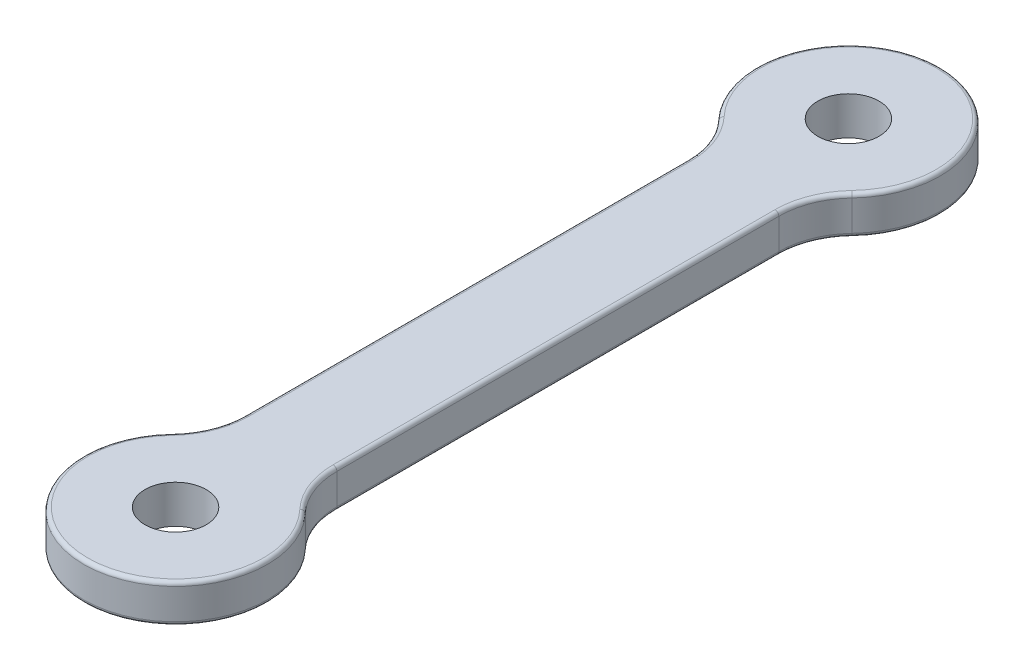
ISO-10303-21;
HEADER;
FILE_DESCRIPTION(('STEP AP214'),'2;1');
FILE_NAME('part.step','',(''),(''),'','','');
FILE_SCHEMA(('AUTOMOTIVE_DESIGN { 1 0 10303 214 1 1 1 1 }'));
ENDSEC;
DATA;
#1=APPLICATION_CONTEXT('core data for automotive mechanical design processes');
#2=APPLICATION_PROTOCOL_DEFINITION('international standard','automotive_design',2000,#1);
#3=PRODUCT_CONTEXT('',#1,'mechanical');
#4=PRODUCT('Part','Part','',(#3));
#5=PRODUCT_RELATED_PRODUCT_CATEGORY('part','',(#4));
#6=PRODUCT_DEFINITION_FORMATION('','',#4);
#7=PRODUCT_DEFINITION_CONTEXT('part definition',#1,'design');
#8=PRODUCT_DEFINITION('design','',#6,#7);
#9=PRODUCT_DEFINITION_SHAPE('','',#8);
#10=(LENGTH_UNIT() NAMED_UNIT(*) SI_UNIT(.MILLI.,.METRE.));
#11=(NAMED_UNIT(*) PLANE_ANGLE_UNIT() SI_UNIT($,.RADIAN.));
#12=(NAMED_UNIT(*) SI_UNIT($,.STERADIAN.) SOLID_ANGLE_UNIT());
#13=UNCERTAINTY_MEASURE_WITH_UNIT(LENGTH_MEASURE(1.E-05),#10,'distance_accuracy_value','');
#14=(GEOMETRIC_REPRESENTATION_CONTEXT(3) GLOBAL_UNCERTAINTY_ASSIGNED_CONTEXT((#13)) GLOBAL_UNIT_ASSIGNED_CONTEXT((#10,
#11,#12)) REPRESENTATION_CONTEXT('',''));
#15=CARTESIAN_POINT('',(0.,0.,0.));
#16=DIRECTION('',(0.,0.,1.));
#17=DIRECTION('',(1.,0.,0.));
#18=AXIS2_PLACEMENT_3D('',#15,#16,#17);
#19=CARTESIAN_POINT('',(0.,2.5,22.));
#20=DIRECTION('',(0.,-1.,0.));
#21=DIRECTION('',(0.,0.,-1.));
#22=AXIS2_PLACEMENT_3D('',#19,#20,#21);
#23=CYLINDRICAL_SURFACE('',#22,6.);
#24=DIRECTION('',(0.,-1.,0.));
#25=VECTOR('',#24,1.);
#26=CARTESIAN_POINT('',(4.36363636363637,2.5,17.8819084898523));
#27=LINE('',#26,#25);
#28=CARTESIAN_POINT('',(4.36363636363637,0.25,17.8819084898523));
#29=VERTEX_POINT('',#28);
#30=CARTESIAN_POINT('',(4.36363636363637,2.25,17.8819084898523));
#31=VERTEX_POINT('',#30);
#32=EDGE_CURVE('E306',#29,#31,#27,.F.);
#33=ORIENTED_EDGE('',*,*,#32,.T.);
#34=CARTESIAN_POINT('',(0.,2.25,22.));
#35=DIRECTION('',(0.,1.,0.));
#36=DIRECTION('',(0.,0.,1.));
#37=AXIS2_PLACEMENT_3D('',#34,#35,#36);
#38=CIRCLE('',#37,6.);
#39=CARTESIAN_POINT('',(-4.36363636363636,2.25,17.8819084898523));
#40=VERTEX_POINT('',#39);
#41=EDGE_CURVE('E11',#31,#40,#38,.F.);
#42=ORIENTED_EDGE('',*,*,#41,.T.);
#43=DIRECTION('',(0.,-1.,0.));
#44=VECTOR('',#43,1.);
#45=CARTESIAN_POINT('',(-4.36363636363636,2.5,17.8819084898523));
#46=LINE('',#45,#44);
#47=CARTESIAN_POINT('',(-4.36363636363636,0.25,17.8819084898523));
#48=VERTEX_POINT('',#47);
#49=EDGE_CURVE('E303',#40,#48,#46,.T.);
#50=ORIENTED_EDGE('',*,*,#49,.T.);
#51=CARTESIAN_POINT('',(0.,0.25,22.));
#52=DIRECTION('',(0.,1.,0.));
#53=DIRECTION('',(0.,0.,1.));
#54=AXIS2_PLACEMENT_3D('',#51,#52,#53);
#55=CIRCLE('',#54,6.);
#56=EDGE_CURVE('E48',#48,#29,#55,.T.);
#57=ORIENTED_EDGE('',*,*,#56,.T.);
#58=EDGE_LOOP('',(#33,#42,#50,#57));
#59=FACE_BOUND('',#58,.T.);
#60=ADVANCED_FACE('F39',(#59),#23,.T.);
#61=CARTESIAN_POINT('',(3.,2.5,0.));
#62=DIRECTION('',(-1.,0.,0.));
#63=DIRECTION('',(0.,0.,1.));
#64=AXIS2_PLACEMENT_3D('',#61,#62,#63);
#65=PLANE('',#64);
#66=DIRECTION('',(0.,1.,0.));
#67=VECTOR('',#66,1.);
#68=CARTESIAN_POINT('',(3.,2.5,-14.4501655647292));
#69=LINE('',#68,#67);
#70=CARTESIAN_POINT('',(3.,0.25,-14.4501655647292));
#71=VERTEX_POINT('',#70);
#72=CARTESIAN_POINT('',(3.,2.25,-14.4501655647292));
#73=VERTEX_POINT('',#72);
#74=EDGE_CURVE('E287',#71,#73,#69,.T.);
#75=ORIENTED_EDGE('',*,*,#74,.T.);
#76=DIRECTION('',(0.,0.,-1.));
#77=VECTOR('',#76,1.);
#78=CARTESIAN_POINT('',(3.,2.25,14.4501655647292));
#79=LINE('',#78,#77);
#80=CARTESIAN_POINT('',(3.,2.25,14.4501655647292));
#81=VERTEX_POINT('',#80);
#82=EDGE_CURVE('E209',#73,#81,#79,.F.);
#83=ORIENTED_EDGE('',*,*,#82,.T.);
#84=DIRECTION('',(0.,1.,0.));
#85=VECTOR('',#84,1.);
#86=CARTESIAN_POINT('',(3.,0.,14.4501655647292));
#87=LINE('',#86,#85);
#88=CARTESIAN_POINT('',(3.,0.25,14.4501655647292));
#89=VERTEX_POINT('',#88);
#90=EDGE_CURVE('E293',#81,#89,#87,.F.);
#91=ORIENTED_EDGE('',*,*,#90,.T.);
#92=DIRECTION('',(0.,0.,-1.));
#93=VECTOR('',#92,1.);
#94=CARTESIAN_POINT('',(3.,0.25,0.));
#95=LINE('',#94,#93);
#96=EDGE_CURVE('E207',#89,#71,#95,.T.);
#97=ORIENTED_EDGE('',*,*,#96,.T.);
#98=EDGE_LOOP('',(#75,#83,#91,#97));
#99=FACE_BOUND('',#98,.T.);
#100=ADVANCED_FACE('F379',(#99),#65,.F.);
#101=CARTESIAN_POINT('',(0.,2.5,-22.));
#102=DIRECTION('',(0.,-1.,0.));
#103=DIRECTION('',(0.,0.,-1.));
#104=AXIS2_PLACEMENT_3D('',#101,#102,#103);
#105=CYLINDRICAL_SURFACE('',#104,6.);
#106=DIRECTION('',(0.,-1.,0.));
#107=VECTOR('',#106,1.);
#108=CARTESIAN_POINT('',(-4.36363636363636,2.5,-17.8819084898523));
#109=LINE('',#108,#107);
#110=CARTESIAN_POINT('',(-4.36363636363636,0.25,-17.8819084898523));
#111=VERTEX_POINT('',#110);
#112=CARTESIAN_POINT('',(-4.36363636363636,2.25,-17.8819084898523));
#113=VERTEX_POINT('',#112);
#114=EDGE_CURVE('E294',#111,#113,#109,.F.);
#115=ORIENTED_EDGE('',*,*,#114,.T.);
#116=CARTESIAN_POINT('',(0.,2.25,-22.));
#117=DIRECTION('',(0.,1.,0.));
#118=DIRECTION('',(0.,0.,1.));
#119=AXIS2_PLACEMENT_3D('',#116,#117,#118);
#120=CIRCLE('',#119,6.);
#121=CARTESIAN_POINT('',(4.36363636363637,2.25,-17.8819084898523));
#122=VERTEX_POINT('',#121);
#123=EDGE_CURVE('E201',#113,#122,#120,.F.);
#124=ORIENTED_EDGE('',*,*,#123,.T.);
#125=DIRECTION('',(0.,-1.,0.));
#126=VECTOR('',#125,1.);
#127=CARTESIAN_POINT('',(4.36363636363637,2.5,-17.8819084898523));
#128=LINE('',#127,#126);
#129=CARTESIAN_POINT('',(4.36363636363637,0.25,-17.8819084898523));
#130=VERTEX_POINT('',#129);
#131=EDGE_CURVE('E284',#122,#130,#128,.T.);
#132=ORIENTED_EDGE('',*,*,#131,.T.);
#133=CARTESIAN_POINT('',(0.,0.25,-22.));
#134=DIRECTION('',(0.,1.,0.));
#135=DIRECTION('',(0.,0.,1.));
#136=AXIS2_PLACEMENT_3D('',#133,#134,#135);
#137=CIRCLE('',#136,6.);
#138=EDGE_CURVE('E199',#130,#111,#137,.T.);
#139=ORIENTED_EDGE('',*,*,#138,.T.);
#140=EDGE_LOOP('',(#115,#124,#132,#139));
#141=FACE_BOUND('',#140,.T.);
#142=ADVANCED_FACE('F290',(#141),#105,.T.);
#143=CARTESIAN_POINT('',(0.,2.5,22.));
#144=DIRECTION('',(0.,-1.,0.));
#145=DIRECTION('',(0.,0.,-1.));
#146=AXIS2_PLACEMENT_3D('',#143,#144,#145);
#147=CYLINDRICAL_SURFACE('',#146,2.);
#148=CARTESIAN_POINT('',(0.,2.5,22.));
#149=DIRECTION('',(0.,1.,0.));
#150=DIRECTION('',(0.,0.,1.));
#151=AXIS2_PLACEMENT_3D('',#148,#149,#150);
#152=CIRCLE('',#151,2.);
#153=CARTESIAN_POINT('',(0.,2.5,24.));
#154=VERTEX_POINT('',#153);
#155=EDGE_CURVE('E610',#154,#154,#152,.T.);
#156=ORIENTED_EDGE('',*,*,#155,.T.);
#157=EDGE_LOOP('',(#156));
#158=FACE_BOUND('',#157,.T.);
#159=CARTESIAN_POINT('',(0.,0.,22.));
#160=DIRECTION('',(0.,1.,0.));
#161=DIRECTION('',(0.,0.,1.));
#162=AXIS2_PLACEMENT_3D('',#159,#160,#161);
#163=CIRCLE('',#162,2.);
#164=CARTESIAN_POINT('',(0.,0.,24.));
#165=VERTEX_POINT('',#164);
#166=EDGE_CURVE('E248',#165,#165,#163,.T.);
#167=ORIENTED_EDGE('',*,*,#166,.F.);
#168=EDGE_LOOP('',(#167));
#169=FACE_BOUND('',#168,.T.);
#170=ADVANCED_FACE('F568',(#158,#169),#147,.F.);
#171=CARTESIAN_POINT('',(-3.,2.5,0.));
#172=DIRECTION('',(-1.,0.,0.));
#173=DIRECTION('',(0.,0.,1.));
#174=AXIS2_PLACEMENT_3D('',#171,#172,#173);
#175=PLANE('',#174);
#176=DIRECTION('',(0.,-1.,0.));
#177=VECTOR('',#176,1.);
#178=CARTESIAN_POINT('',(-3.,2.5,14.4501655647292));
#179=LINE('',#178,#177);
#180=CARTESIAN_POINT('',(-3.,0.25,14.4501655647292));
#181=VERTEX_POINT('',#180);
#182=CARTESIAN_POINT('',(-3.,2.25,14.4501655647292));
#183=VERTEX_POINT('',#182);
#184=EDGE_CURVE('E175',#181,#183,#179,.F.);
#185=ORIENTED_EDGE('',*,*,#184,.T.);
#186=DIRECTION('',(0.,0.,-1.));
#187=VECTOR('',#186,1.);
#188=CARTESIAN_POINT('',(-3.,2.25,0.));
#189=LINE('',#188,#187);
#190=CARTESIAN_POINT('',(-3.,2.25,-14.4501655647292));
#191=VERTEX_POINT('',#190);
#192=EDGE_CURVE('E193',#183,#191,#189,.T.);
#193=ORIENTED_EDGE('',*,*,#192,.T.);
#194=DIRECTION('',(0.,-1.,0.));
#195=VECTOR('',#194,1.);
#196=CARTESIAN_POINT('',(-3.,2.5,-14.4501655647292));
#197=LINE('',#196,#195);
#198=CARTESIAN_POINT('',(-3.,0.25,-14.4501655647292));
#199=VERTEX_POINT('',#198);
#200=EDGE_CURVE('E309',#191,#199,#197,.T.);
#201=ORIENTED_EDGE('',*,*,#200,.T.);
#202=DIRECTION('',(0.,0.,-1.));
#203=VECTOR('',#202,1.);
#204=CARTESIAN_POINT('',(-3.,0.25,14.4501655647292));
#205=LINE('',#204,#203);
#206=EDGE_CURVE('E191',#199,#181,#205,.F.);
#207=ORIENTED_EDGE('',*,*,#206,.T.);
#208=EDGE_LOOP('',(#185,#193,#201,#207));
#209=FACE_BOUND('',#208,.T.);
#210=ADVANCED_FACE('F336',(#209),#175,.T.);
#211=CARTESIAN_POINT('',(0.,2.5,-22.));
#212=DIRECTION('',(0.,-1.,0.));
#213=DIRECTION('',(0.,0.,-1.));
#214=AXIS2_PLACEMENT_3D('',#211,#212,#213);
#215=CYLINDRICAL_SURFACE('',#214,2.);
#216=CARTESIAN_POINT('',(0.,2.5,-22.));
#217=DIRECTION('',(0.,1.,0.));
#218=DIRECTION('',(0.,0.,1.));
#219=AXIS2_PLACEMENT_3D('',#216,#217,#218);
#220=CIRCLE('',#219,2.);
#221=CARTESIAN_POINT('',(0.,2.5,-20.));
#222=VERTEX_POINT('',#221);
#223=EDGE_CURVE('E298',#222,#222,#220,.T.);
#224=ORIENTED_EDGE('',*,*,#223,.T.);
#225=EDGE_LOOP('',(#224));
#226=FACE_BOUND('',#225,.T.);
#227=CARTESIAN_POINT('',(0.,0.,-22.));
#228=DIRECTION('',(0.,1.,0.));
#229=DIRECTION('',(0.,0.,1.));
#230=AXIS2_PLACEMENT_3D('',#227,#228,#229);
#231=CIRCLE('',#230,2.);
#232=CARTESIAN_POINT('',(0.,0.,-20.));
#233=VERTEX_POINT('',#232);
#234=EDGE_CURVE('E613',#233,#233,#231,.T.);
#235=ORIENTED_EDGE('',*,*,#234,.F.);
#236=EDGE_LOOP('',(#235));
#237=FACE_BOUND('',#236,.T.);
#238=ADVANCED_FACE('F556',(#226,#237),#215,.F.);
#239=CARTESIAN_POINT('',(0.,2.5,0.));
#240=DIRECTION('',(0.,1.,0.));
#241=DIRECTION('',(0.,0.,1.));
#242=AXIS2_PLACEMENT_3D('',#239,#240,#241);
#243=PLANE('',#242);
#244=DIRECTION('',(0.,0.,-1.));
#245=VECTOR('',#244,1.);
#246=CARTESIAN_POINT('',(-2.75,2.5,0.));
#247=LINE('',#246,#245);
#248=CARTESIAN_POINT('',(-2.75,2.5,-14.4501655647292));
#249=VERTEX_POINT('',#248);
#250=CARTESIAN_POINT('',(-2.75,2.5,14.4501655647292));
#251=VERTEX_POINT('',#250);
#252=EDGE_CURVE('E180',#249,#251,#247,.F.);
#253=ORIENTED_EDGE('',*,*,#252,.T.);
#254=CARTESIAN_POINT('',(-8.,2.5,14.4501655647292));
#255=DIRECTION('',(0.,1.,0.));
#256=DIRECTION('',(0.,0.,1.));
#257=AXIS2_PLACEMENT_3D('',#254,#255,#256);
#258=CIRCLE('',#257,5.25);
#259=CARTESIAN_POINT('',(-4.18181818181818,2.5,18.0534956361085));
#260=VERTEX_POINT('',#259);
#261=EDGE_CURVE('E160',#251,#260,#258,.F.);
#262=ORIENTED_EDGE('',*,*,#261,.T.);
#263=CARTESIAN_POINT('',(0.,2.5,22.));
#264=DIRECTION('',(0.,1.,0.));
#265=DIRECTION('',(0.,0.,1.));
#266=AXIS2_PLACEMENT_3D('',#263,#264,#265);
#267=CIRCLE('',#266,5.75);
#268=CARTESIAN_POINT('',(4.18181818181818,2.5,18.0534956361085));
#269=VERTEX_POINT('',#268);
#270=EDGE_CURVE('E168',#260,#269,#267,.T.);
#271=ORIENTED_EDGE('',*,*,#270,.T.);
#272=CARTESIAN_POINT('',(8.,2.5,14.4501655647292));
#273=DIRECTION('',(0.,1.,0.));
#274=DIRECTION('',(0.,0.,1.));
#275=AXIS2_PLACEMENT_3D('',#272,#273,#274);
#276=CIRCLE('',#275,5.25);
#277=CARTESIAN_POINT('',(2.75,2.5,14.4501655647292));
#278=VERTEX_POINT('',#277);
#279=EDGE_CURVE('E174',#269,#278,#276,.F.);
#280=ORIENTED_EDGE('',*,*,#279,.T.);
#281=DIRECTION('',(0.,0.,-1.));
#282=VECTOR('',#281,1.);
#283=CARTESIAN_POINT('',(2.75,2.5,-14.4501655647292));
#284=LINE('',#283,#282);
#285=CARTESIAN_POINT('',(2.75,2.5,-14.4501655647292));
#286=VERTEX_POINT('',#285);
#287=EDGE_CURVE('E315',#278,#286,#284,.T.);
#288=ORIENTED_EDGE('',*,*,#287,.T.);
#289=CARTESIAN_POINT('',(8.,2.5,-14.4501655647292));
#290=DIRECTION('',(0.,1.,0.));
#291=DIRECTION('',(0.,0.,1.));
#292=AXIS2_PLACEMENT_3D('',#289,#290,#291);
#293=CIRCLE('',#292,5.25);
#294=CARTESIAN_POINT('',(4.18181818181818,2.5,-18.0534956361085));
#295=VERTEX_POINT('',#294);
#296=EDGE_CURVE('E317',#286,#295,#293,.F.);
#297=ORIENTED_EDGE('',*,*,#296,.T.);
#298=CARTESIAN_POINT('',(0.,2.5,-22.));
#299=DIRECTION('',(0.,1.,0.));
#300=DIRECTION('',(0.,0.,1.));
#301=AXIS2_PLACEMENT_3D('',#298,#299,#300);
#302=CIRCLE('',#301,5.75);
#303=CARTESIAN_POINT('',(-4.18181818181818,2.5,-18.0534956361085));
#304=VERTEX_POINT('',#303);
#305=EDGE_CURVE('E319',#295,#304,#302,.T.);
#306=ORIENTED_EDGE('',*,*,#305,.T.);
#307=CARTESIAN_POINT('',(-8.,2.5,-14.4501655647292));
#308=DIRECTION('',(0.,1.,0.));
#309=DIRECTION('',(0.,0.,1.));
#310=AXIS2_PLACEMENT_3D('',#307,#308,#309);
#311=CIRCLE('',#310,5.25);
#312=EDGE_CURVE('E186',#304,#249,#311,.F.);
#313=ORIENTED_EDGE('',*,*,#312,.T.);
#314=EDGE_LOOP('',(#253,#262,#271,#280,#288,#297,#306,#313));
#315=FACE_BOUND('',#314,.T.);
#316=ORIENTED_EDGE('',*,*,#155,.F.);
#317=EDGE_LOOP('',(#316));
#318=FACE_BOUND('',#317,.T.);
#319=ORIENTED_EDGE('',*,*,#223,.F.);
#320=EDGE_LOOP('',(#319));
#321=FACE_BOUND('',#320,.T.);
#322=ADVANCED_FACE('F177',(#315,#318,#321),#243,.T.);
#323=CARTESIAN_POINT('',(0.,0.,0.));
#324=DIRECTION('',(0.,1.,0.));
#325=DIRECTION('',(0.,0.,1.));
#326=AXIS2_PLACEMENT_3D('',#323,#324,#325);
#327=PLANE('',#326);
#328=CARTESIAN_POINT('',(0.,0.,22.));
#329=DIRECTION('',(0.,1.,0.));
#330=DIRECTION('',(0.,0.,1.));
#331=AXIS2_PLACEMENT_3D('',#328,#329,#330);
#332=CIRCLE('',#331,5.75);
#333=CARTESIAN_POINT('',(4.18181818181818,0.,18.0534956361085));
#334=VERTEX_POINT('',#333);
#335=CARTESIAN_POINT('',(-4.18181818181818,0.,18.0534956361085));
#336=VERTEX_POINT('',#335);
#337=EDGE_CURVE('E215',#334,#336,#332,.F.);
#338=ORIENTED_EDGE('',*,*,#337,.T.);
#339=CARTESIAN_POINT('',(-8.,0.,14.4501655647292));
#340=DIRECTION('',(0.,1.,0.));
#341=DIRECTION('',(0.,0.,1.));
#342=AXIS2_PLACEMENT_3D('',#339,#340,#341);
#343=CIRCLE('',#342,5.25);
#344=CARTESIAN_POINT('',(-2.75,0.,14.4501655647292));
#345=VERTEX_POINT('',#344);
#346=EDGE_CURVE('E228',#336,#345,#343,.T.);
#347=ORIENTED_EDGE('',*,*,#346,.T.);
#348=DIRECTION('',(0.,0.,-1.));
#349=VECTOR('',#348,1.);
#350=CARTESIAN_POINT('',(-2.75,0.,-14.4501655647292));
#351=LINE('',#350,#349);
#352=CARTESIAN_POINT('',(-2.75,0.,-14.4501655647292));
#353=VERTEX_POINT('',#352);
#354=EDGE_CURVE('E63',#345,#353,#351,.T.);
#355=ORIENTED_EDGE('',*,*,#354,.T.);
#356=CARTESIAN_POINT('',(-8.,0.,-14.4501655647292));
#357=DIRECTION('',(0.,1.,0.));
#358=DIRECTION('',(0.,0.,1.));
#359=AXIS2_PLACEMENT_3D('',#356,#357,#358);
#360=CIRCLE('',#359,5.25);
#361=CARTESIAN_POINT('',(-4.18181818181818,0.,-18.0534956361085));
#362=VERTEX_POINT('',#361);
#363=EDGE_CURVE('E225',#353,#362,#360,.T.);
#364=ORIENTED_EDGE('',*,*,#363,.T.);
#365=CARTESIAN_POINT('',(0.,0.,-22.));
#366=DIRECTION('',(0.,1.,0.));
#367=DIRECTION('',(0.,0.,1.));
#368=AXIS2_PLACEMENT_3D('',#365,#366,#367);
#369=CIRCLE('',#368,5.75);
#370=CARTESIAN_POINT('',(4.18181818181818,0.,-18.0534956361085));
#371=VERTEX_POINT('',#370);
#372=EDGE_CURVE('E223',#362,#371,#369,.F.);
#373=ORIENTED_EDGE('',*,*,#372,.T.);
#374=CARTESIAN_POINT('',(8.,0.,-14.4501655647292));
#375=DIRECTION('',(0.,1.,0.));
#376=DIRECTION('',(0.,0.,1.));
#377=AXIS2_PLACEMENT_3D('',#374,#375,#376);
#378=CIRCLE('',#377,5.25);
#379=CARTESIAN_POINT('',(2.75,0.,-14.4501655647292));
#380=VERTEX_POINT('',#379);
#381=EDGE_CURVE('E221',#371,#380,#378,.T.);
#382=ORIENTED_EDGE('',*,*,#381,.T.);
#383=DIRECTION('',(0.,0.,-1.));
#384=VECTOR('',#383,1.);
#385=CARTESIAN_POINT('',(2.75,0.,0.));
#386=LINE('',#385,#384);
#387=CARTESIAN_POINT('',(2.75,0.,14.4501655647292));
#388=VERTEX_POINT('',#387);
#389=EDGE_CURVE('E219',#380,#388,#386,.F.);
#390=ORIENTED_EDGE('',*,*,#389,.T.);
#391=CARTESIAN_POINT('',(8.,0.,14.4501655647292));
#392=DIRECTION('',(0.,1.,0.));
#393=DIRECTION('',(0.,0.,1.));
#394=AXIS2_PLACEMENT_3D('',#391,#392,#393);
#395=CIRCLE('',#394,5.25);
#396=EDGE_CURVE('E217',#388,#334,#395,.T.);
#397=ORIENTED_EDGE('',*,*,#396,.T.);
#398=EDGE_LOOP('',(#338,#347,#355,#364,#373,#382,#390,#397));
#399=FACE_BOUND('',#398,.T.);
#400=ORIENTED_EDGE('',*,*,#166,.T.);
#401=EDGE_LOOP('',(#400));
#402=FACE_BOUND('',#401,.T.);
#403=ORIENTED_EDGE('',*,*,#234,.T.);
#404=EDGE_LOOP('',(#403));
#405=FACE_BOUND('',#404,.T.);
#406=ADVANCED_FACE('F341',(#399,#402,#405),#327,.F.);
#407=CARTESIAN_POINT('',(8.,2.5,-14.4501655647292));
#408=DIRECTION('',(0.,-1.,0.));
#409=DIRECTION('',(0.,0.,-1.));
#410=AXIS2_PLACEMENT_3D('',#407,#408,#409);
#411=CYLINDRICAL_SURFACE('',#410,5.);
#412=ORIENTED_EDGE('',*,*,#131,.F.);
#413=CARTESIAN_POINT('',(8.,2.25,-14.4501655647292));
#414=DIRECTION('',(0.,1.,0.));
#415=DIRECTION('',(0.,0.,1.));
#416=AXIS2_PLACEMENT_3D('',#413,#414,#415);
#417=CIRCLE('',#416,5.);
#418=EDGE_CURVE('E205',#122,#73,#417,.T.);
#419=ORIENTED_EDGE('',*,*,#418,.T.);
#420=ORIENTED_EDGE('',*,*,#74,.F.);
#421=CARTESIAN_POINT('',(8.,0.25,-14.4501655647292));
#422=DIRECTION('',(0.,1.,0.));
#423=DIRECTION('',(0.,0.,1.));
#424=AXIS2_PLACEMENT_3D('',#421,#422,#423);
#425=CIRCLE('',#424,5.);
#426=EDGE_CURVE('E203',#71,#130,#425,.F.);
#427=ORIENTED_EDGE('',*,*,#426,.T.);
#428=EDGE_LOOP('',(#412,#419,#420,#427));
#429=FACE_BOUND('',#428,.T.);
#430=ADVANCED_FACE('F283',(#429),#411,.F.);
#431=CARTESIAN_POINT('',(8.,2.5,14.4501655647292));
#432=DIRECTION('',(0.,-1.,0.));
#433=DIRECTION('',(0.,0.,-1.));
#434=AXIS2_PLACEMENT_3D('',#431,#432,#433);
#435=CYLINDRICAL_SURFACE('',#434,5.);
#436=ORIENTED_EDGE('',*,*,#90,.F.);
#437=CARTESIAN_POINT('',(8.,2.25,14.4501655647292));
#438=DIRECTION('',(0.,1.,0.));
#439=DIRECTION('',(0.,0.,1.));
#440=AXIS2_PLACEMENT_3D('',#437,#438,#439);
#441=CIRCLE('',#440,5.);
#442=EDGE_CURVE('E213',#81,#31,#441,.T.);
#443=ORIENTED_EDGE('',*,*,#442,.T.);
#444=ORIENTED_EDGE('',*,*,#32,.F.);
#445=CARTESIAN_POINT('',(8.,0.25,14.4501655647292));
#446=DIRECTION('',(0.,1.,0.));
#447=DIRECTION('',(0.,0.,1.));
#448=AXIS2_PLACEMENT_3D('',#445,#446,#447);
#449=CIRCLE('',#448,5.);
#450=EDGE_CURVE('E211',#29,#89,#449,.F.);
#451=ORIENTED_EDGE('',*,*,#450,.T.);
#452=EDGE_LOOP('',(#436,#443,#444,#451));
#453=FACE_BOUND('',#452,.T.);
#454=ADVANCED_FACE('F390',(#453),#435,.F.);
#455=CARTESIAN_POINT('',(-8.,2.5,14.4501655647292));
#456=DIRECTION('',(0.,-1.,0.));
#457=DIRECTION('',(0.,0.,-1.));
#458=AXIS2_PLACEMENT_3D('',#455,#456,#457);
#459=CYLINDRICAL_SURFACE('',#458,5.);
#460=ORIENTED_EDGE('',*,*,#49,.F.);
#461=CARTESIAN_POINT('',(-8.,2.25,14.4501655647292));
#462=DIRECTION('',(0.,1.,0.));
#463=DIRECTION('',(0.,0.,1.));
#464=AXIS2_PLACEMENT_3D('',#461,#462,#463);
#465=CIRCLE('',#464,5.);
#466=EDGE_CURVE('E162',#40,#183,#465,.T.);
#467=ORIENTED_EDGE('',*,*,#466,.T.);
#468=ORIENTED_EDGE('',*,*,#184,.F.);
#469=CARTESIAN_POINT('',(-8.,0.25,14.4501655647292));
#470=DIRECTION('',(0.,1.,0.));
#471=DIRECTION('',(0.,0.,1.));
#472=AXIS2_PLACEMENT_3D('',#469,#470,#471);
#473=CIRCLE('',#472,5.);
#474=EDGE_CURVE('E182',#181,#48,#473,.F.);
#475=ORIENTED_EDGE('',*,*,#474,.T.);
#476=EDGE_LOOP('',(#460,#467,#468,#475));
#477=FACE_BOUND('',#476,.T.);
#478=ADVANCED_FACE('F335',(#477),#459,.F.);
#479=CARTESIAN_POINT('',(-8.,2.5,-14.4501655647292));
#480=DIRECTION('',(0.,-1.,0.));
#481=DIRECTION('',(0.,0.,-1.));
#482=AXIS2_PLACEMENT_3D('',#479,#480,#481);
#483=CYLINDRICAL_SURFACE('',#482,5.);
#484=ORIENTED_EDGE('',*,*,#200,.F.);
#485=CARTESIAN_POINT('',(-8.,2.25,-14.4501655647292));
#486=DIRECTION('',(0.,1.,0.));
#487=DIRECTION('',(0.,0.,1.));
#488=AXIS2_PLACEMENT_3D('',#485,#486,#487);
#489=CIRCLE('',#488,5.);
#490=EDGE_CURVE('E197',#191,#113,#489,.T.);
#491=ORIENTED_EDGE('',*,*,#490,.T.);
#492=ORIENTED_EDGE('',*,*,#114,.F.);
#493=CARTESIAN_POINT('',(-8.,0.25,-14.4501655647292));
#494=DIRECTION('',(0.,1.,0.));
#495=DIRECTION('',(0.,0.,1.));
#496=AXIS2_PLACEMENT_3D('',#493,#494,#495);
#497=CIRCLE('',#496,5.);
#498=EDGE_CURVE('E195',#111,#199,#497,.F.);
#499=ORIENTED_EDGE('',*,*,#498,.T.);
#500=EDGE_LOOP('',(#484,#491,#492,#499));
#501=FACE_BOUND('',#500,.T.);
#502=ADVANCED_FACE('F376',(#501),#483,.F.);
#503=CARTESIAN_POINT('',(8.,2.25,-14.4501655647292));
#504=DIRECTION('',(0.,1.,0.));
#505=DIRECTION('',(0.,0.,1.));
#506=AXIS2_PLACEMENT_3D('',#503,#504,#505);
#507=TOROIDAL_SURFACE('',#506,5.25,0.25);
#508=CARTESIAN_POINT('',(2.75,2.25,-14.4501655647292));
#509=DIRECTION('',(0.,0.,1.));
#510=DIRECTION('',(1.,0.,0.));
#511=AXIS2_PLACEMENT_3D('',#508,#509,#510);
#512=CIRCLE('',#511,0.25);
#513=EDGE_CURVE('E242',#73,#286,#512,.T.);
#514=ORIENTED_EDGE('',*,*,#513,.F.);
#515=ORIENTED_EDGE('',*,*,#418,.F.);
#516=CARTESIAN_POINT('',(4.18181818181818,2.25,-18.0534956361085));
#517=DIRECTION('',(0.686348585024614,0.,-0.727272727272727));
#518=DIRECTION('',(-0.727272727272727,0.,-0.686348585024614));
#519=AXIS2_PLACEMENT_3D('',#516,#517,#518);
#520=CIRCLE('',#519,0.25);
#521=EDGE_CURVE('E245',#295,#122,#520,.T.);
#522=ORIENTED_EDGE('',*,*,#521,.F.);
#523=ORIENTED_EDGE('',*,*,#296,.F.);
#524=EDGE_LOOP('',(#514,#515,#522,#523));
#525=FACE_BOUND('',#524,.T.);
#526=ADVANCED_FACE('F365',(#525),#507,.T.);
#527=CARTESIAN_POINT('',(0.,2.25,-22.));
#528=DIRECTION('',(0.,1.,0.));
#529=DIRECTION('',(0.,0.,1.));
#530=AXIS2_PLACEMENT_3D('',#527,#528,#529);
#531=TOROIDAL_SURFACE('',#530,5.75,0.25);
#532=ORIENTED_EDGE('',*,*,#521,.T.);
#533=ORIENTED_EDGE('',*,*,#123,.F.);
#534=CARTESIAN_POINT('',(-4.18181818181818,2.25,-18.0534956361085));
#535=DIRECTION('',(0.686348585024615,0.,0.727272727272726));
#536=DIRECTION('',(0.727272727272726,0.,-0.686348585024615));
#537=AXIS2_PLACEMENT_3D('',#534,#535,#536);
#538=CIRCLE('',#537,0.25);
#539=EDGE_CURVE('E239',#304,#113,#538,.T.);
#540=ORIENTED_EDGE('',*,*,#539,.F.);
#541=ORIENTED_EDGE('',*,*,#305,.F.);
#542=EDGE_LOOP('',(#532,#533,#540,#541));
#543=FACE_BOUND('',#542,.T.);
#544=ADVANCED_FACE('F368',(#543),#531,.T.);
#545=CARTESIAN_POINT('',(2.75,2.25,0.));
#546=DIRECTION('',(0.,0.,1.));
#547=DIRECTION('',(1.,0.,0.));
#548=AXIS2_PLACEMENT_3D('',#545,#546,#547);
#549=CYLINDRICAL_SURFACE('',#548,0.25);
#550=ORIENTED_EDGE('',*,*,#513,.T.);
#551=ORIENTED_EDGE('',*,*,#287,.F.);
#552=CARTESIAN_POINT('',(2.75,2.25,14.4501655647292));
#553=DIRECTION('',(0.,0.,1.));
#554=DIRECTION('',(1.,0.,0.));
#555=AXIS2_PLACEMENT_3D('',#552,#553,#554);
#556=CIRCLE('',#555,0.25);
#557=EDGE_CURVE('E236',#81,#278,#556,.T.);
#558=ORIENTED_EDGE('',*,*,#557,.F.);
#559=ORIENTED_EDGE('',*,*,#82,.F.);
#560=EDGE_LOOP('',(#550,#551,#558,#559));
#561=FACE_BOUND('',#560,.T.);
#562=ADVANCED_FACE('F361',(#561),#549,.T.);
#563=CARTESIAN_POINT('',(-8.,2.25,-14.4501655647292));
#564=DIRECTION('',(0.,1.,0.));
#565=DIRECTION('',(0.,0.,1.));
#566=AXIS2_PLACEMENT_3D('',#563,#564,#565);
#567=TOROIDAL_SURFACE('',#566,5.25,0.25);
#568=ORIENTED_EDGE('',*,*,#539,.T.);
#569=ORIENTED_EDGE('',*,*,#490,.F.);
#570=CARTESIAN_POINT('',(-2.75,2.25,-14.4501655647292));
#571=DIRECTION('',(0.,0.,1.));
#572=DIRECTION('',(1.,0.,0.));
#573=AXIS2_PLACEMENT_3D('',#570,#571,#572);
#574=CIRCLE('',#573,0.25);
#575=EDGE_CURVE('E233',#249,#191,#574,.T.);
#576=ORIENTED_EDGE('',*,*,#575,.F.);
#577=ORIENTED_EDGE('',*,*,#312,.F.);
#578=EDGE_LOOP('',(#568,#569,#576,#577));
#579=FACE_BOUND('',#578,.T.);
#580=ADVANCED_FACE('F326',(#579),#567,.T.);
#581=CARTESIAN_POINT('',(8.,2.25,14.4501655647292));
#582=DIRECTION('',(0.,1.,0.));
#583=DIRECTION('',(0.,0.,1.));
#584=AXIS2_PLACEMENT_3D('',#581,#582,#583);
#585=TOROIDAL_SURFACE('',#584,5.25,0.25);
#586=ORIENTED_EDGE('',*,*,#557,.T.);
#587=ORIENTED_EDGE('',*,*,#279,.F.);
#588=CARTESIAN_POINT('',(4.18181818181818,2.25,18.0534956361085));
#589=DIRECTION('',(0.686348585024615,0.,0.727272727272726));
#590=DIRECTION('',(0.727272727272726,0.,-0.686348585024615));
#591=AXIS2_PLACEMENT_3D('',#588,#589,#590);
#592=CIRCLE('',#591,0.25);
#593=EDGE_CURVE('E171',#31,#269,#592,.T.);
#594=ORIENTED_EDGE('',*,*,#593,.F.);
#595=ORIENTED_EDGE('',*,*,#442,.F.);
#596=EDGE_LOOP('',(#586,#587,#594,#595));
#597=FACE_BOUND('',#596,.T.);
#598=ADVANCED_FACE('F356',(#597),#585,.T.);
#599=CARTESIAN_POINT('',(-2.75,2.25,0.));
#600=DIRECTION('',(0.,0.,-1.));
#601=DIRECTION('',(-1.,0.,0.));
#602=AXIS2_PLACEMENT_3D('',#599,#600,#601);
#603=CYLINDRICAL_SURFACE('',#602,0.25);
#604=ORIENTED_EDGE('',*,*,#575,.T.);
#605=ORIENTED_EDGE('',*,*,#192,.F.);
#606=CARTESIAN_POINT('',(-2.75,2.25,14.4501655647292));
#607=DIRECTION('',(0.,0.,1.));
#608=DIRECTION('',(1.,0.,0.));
#609=AXIS2_PLACEMENT_3D('',#606,#607,#608);
#610=CIRCLE('',#609,0.25);
#611=EDGE_CURVE('E165',#251,#183,#610,.T.);
#612=ORIENTED_EDGE('',*,*,#611,.F.);
#613=ORIENTED_EDGE('',*,*,#252,.F.);
#614=EDGE_LOOP('',(#604,#605,#612,#613));
#615=FACE_BOUND('',#614,.T.);
#616=ADVANCED_FACE('F329',(#615),#603,.T.);
#617=CARTESIAN_POINT('',(0.,2.25,22.));
#618=DIRECTION('',(0.,1.,0.));
#619=DIRECTION('',(0.,0.,1.));
#620=AXIS2_PLACEMENT_3D('',#617,#618,#619);
#621=TOROIDAL_SURFACE('',#620,5.75,0.25);
#622=ORIENTED_EDGE('',*,*,#593,.T.);
#623=ORIENTED_EDGE('',*,*,#270,.F.);
#624=CARTESIAN_POINT('',(-4.18181818181818,2.25,18.0534956361085));
#625=DIRECTION('',(0.686348585024615,0.,-0.727272727272726));
#626=DIRECTION('',(-0.727272727272726,0.,-0.686348585024615));
#627=AXIS2_PLACEMENT_3D('',#624,#625,#626);
#628=CIRCLE('',#627,0.25);
#629=EDGE_CURVE('E156',#40,#260,#628,.T.);
#630=ORIENTED_EDGE('',*,*,#629,.F.);
#631=ORIENTED_EDGE('',*,*,#41,.F.);
#632=EDGE_LOOP('',(#622,#623,#630,#631));
#633=FACE_BOUND('',#632,.T.);
#634=ADVANCED_FACE('F169',(#633),#621,.T.);
#635=CARTESIAN_POINT('',(-8.,2.25,14.4501655647292));
#636=DIRECTION('',(0.,1.,0.));
#637=DIRECTION('',(0.,0.,1.));
#638=AXIS2_PLACEMENT_3D('',#635,#636,#637);
#639=TOROIDAL_SURFACE('',#638,5.25,0.25);
#640=ORIENTED_EDGE('',*,*,#611,.T.);
#641=ORIENTED_EDGE('',*,*,#466,.F.);
#642=ORIENTED_EDGE('',*,*,#629,.T.);
#643=ORIENTED_EDGE('',*,*,#261,.F.);
#644=EDGE_LOOP('',(#640,#641,#642,#643));
#645=FACE_BOUND('',#644,.T.);
#646=ADVANCED_FACE('F158',(#645),#639,.T.);
#647=CARTESIAN_POINT('',(8.,0.25,-14.4501655647292));
#648=DIRECTION('',(0.,1.,0.));
#649=DIRECTION('',(0.,0.,1.));
#650=AXIS2_PLACEMENT_3D('',#647,#648,#649);
#651=TOROIDAL_SURFACE('',#650,5.25,0.25);
#652=CARTESIAN_POINT('',(4.18181818181818,0.25,-18.0534956361085));
#653=DIRECTION('',(0.686348585024615,0.,-0.727272727272726));
#654=DIRECTION('',(-0.727272727272726,0.,-0.686348585024615));
#655=AXIS2_PLACEMENT_3D('',#652,#653,#654);
#656=CIRCLE('',#655,0.25);
#657=EDGE_CURVE('E263',#130,#371,#656,.T.);
#658=ORIENTED_EDGE('',*,*,#657,.F.);
#659=ORIENTED_EDGE('',*,*,#426,.F.);
#660=CARTESIAN_POINT('',(2.75,0.25,-14.4501655647292));
#661=DIRECTION('',(0.,0.,1.));
#662=DIRECTION('',(1.,0.,0.));
#663=AXIS2_PLACEMENT_3D('',#660,#661,#662);
#664=CIRCLE('',#663,0.25);
#665=EDGE_CURVE('E43',#380,#71,#664,.T.);
#666=ORIENTED_EDGE('',*,*,#665,.F.);
#667=ORIENTED_EDGE('',*,*,#381,.F.);
#668=EDGE_LOOP('',(#658,#659,#666,#667));
#669=FACE_BOUND('',#668,.T.);
#670=ADVANCED_FACE('F41',(#669),#651,.T.);
#671=CARTESIAN_POINT('',(2.75,0.25,0.));
#672=DIRECTION('',(0.,0.,-1.));
#673=DIRECTION('',(-1.,0.,0.));
#674=AXIS2_PLACEMENT_3D('',#671,#672,#673);
#675=CYLINDRICAL_SURFACE('',#674,0.25);
#676=ORIENTED_EDGE('',*,*,#665,.T.);
#677=ORIENTED_EDGE('',*,*,#96,.F.);
#678=CARTESIAN_POINT('',(2.75,0.25,14.4501655647292));
#679=DIRECTION('',(0.,0.,1.));
#680=DIRECTION('',(1.,0.,0.));
#681=AXIS2_PLACEMENT_3D('',#678,#679,#680);
#682=CIRCLE('',#681,0.25);
#683=EDGE_CURVE('E261',#388,#89,#682,.T.);
#684=ORIENTED_EDGE('',*,*,#683,.F.);
#685=ORIENTED_EDGE('',*,*,#389,.F.);
#686=EDGE_LOOP('',(#676,#677,#684,#685));
#687=FACE_BOUND('',#686,.T.);
#688=ADVANCED_FACE('F274',(#687),#675,.T.);
#689=CARTESIAN_POINT('',(0.,0.25,-22.));
#690=DIRECTION('',(0.,1.,0.));
#691=DIRECTION('',(0.,0.,1.));
#692=AXIS2_PLACEMENT_3D('',#689,#690,#691);
#693=TOROIDAL_SURFACE('',#692,5.75,0.25);
#694=ORIENTED_EDGE('',*,*,#657,.T.);
#695=ORIENTED_EDGE('',*,*,#372,.F.);
#696=CARTESIAN_POINT('',(-4.18181818181818,0.25,-18.0534956361085));
#697=DIRECTION('',(0.686348585024615,0.,0.727272727272726));
#698=DIRECTION('',(0.727272727272726,0.,-0.686348585024615));
#699=AXIS2_PLACEMENT_3D('',#696,#697,#698);
#700=CIRCLE('',#699,0.25);
#701=EDGE_CURVE('E258',#111,#362,#700,.T.);
#702=ORIENTED_EDGE('',*,*,#701,.F.);
#703=ORIENTED_EDGE('',*,*,#138,.F.);
#704=EDGE_LOOP('',(#694,#695,#702,#703));
#705=FACE_BOUND('',#704,.T.);
#706=ADVANCED_FACE('F438',(#705),#693,.T.);
#707=CARTESIAN_POINT('',(8.,0.25,14.4501655647292));
#708=DIRECTION('',(0.,1.,0.));
#709=DIRECTION('',(0.,0.,1.));
#710=AXIS2_PLACEMENT_3D('',#707,#708,#709);
#711=TOROIDAL_SURFACE('',#710,5.25,0.25);
#712=ORIENTED_EDGE('',*,*,#683,.T.);
#713=ORIENTED_EDGE('',*,*,#450,.F.);
#714=CARTESIAN_POINT('',(4.18181818181818,0.25,18.0534956361085));
#715=DIRECTION('',(0.686348585024613,0.,0.727272727272727));
#716=DIRECTION('',(0.727272727272727,0.,-0.686348585024614));
#717=AXIS2_PLACEMENT_3D('',#714,#715,#716);
#718=CIRCLE('',#717,0.25);
#719=EDGE_CURVE('E255',#334,#29,#718,.T.);
#720=ORIENTED_EDGE('',*,*,#719,.F.);
#721=ORIENTED_EDGE('',*,*,#396,.F.);
#722=EDGE_LOOP('',(#712,#713,#720,#721));
#723=FACE_BOUND('',#722,.T.);
#724=ADVANCED_FACE('F444',(#723),#711,.T.);
#725=CARTESIAN_POINT('',(-8.,0.25,-14.4501655647292));
#726=DIRECTION('',(0.,1.,0.));
#727=DIRECTION('',(0.,0.,1.));
#728=AXIS2_PLACEMENT_3D('',#725,#726,#727);
#729=TOROIDAL_SURFACE('',#728,5.25,0.25);
#730=ORIENTED_EDGE('',*,*,#701,.T.);
#731=ORIENTED_EDGE('',*,*,#363,.F.);
#732=CARTESIAN_POINT('',(-2.75,0.25,-14.4501655647292));
#733=DIRECTION('',(0.,0.,1.));
#734=DIRECTION('',(1.,0.,0.));
#735=AXIS2_PLACEMENT_3D('',#732,#733,#734);
#736=CIRCLE('',#735,0.25);
#737=EDGE_CURVE('E252',#199,#353,#736,.T.);
#738=ORIENTED_EDGE('',*,*,#737,.F.);
#739=ORIENTED_EDGE('',*,*,#498,.F.);
#740=EDGE_LOOP('',(#730,#731,#738,#739));
#741=FACE_BOUND('',#740,.T.);
#742=ADVANCED_FACE('F451',(#741),#729,.T.);
#743=CARTESIAN_POINT('',(0.,0.25,22.));
#744=DIRECTION('',(0.,1.,0.));
#745=DIRECTION('',(0.,0.,1.));
#746=AXIS2_PLACEMENT_3D('',#743,#744,#745);
#747=TOROIDAL_SURFACE('',#746,5.75,0.25);
#748=ORIENTED_EDGE('',*,*,#719,.T.);
#749=ORIENTED_EDGE('',*,*,#56,.F.);
#750=CARTESIAN_POINT('',(-4.18181818181818,0.25,18.0534956361085));
#751=DIRECTION('',(0.686348585024615,0.,-0.727272727272726));
#752=DIRECTION('',(-0.727272727272726,0.,-0.686348585024615));
#753=AXIS2_PLACEMENT_3D('',#750,#751,#752);
#754=CIRCLE('',#753,0.25);
#755=EDGE_CURVE('E250',#336,#48,#754,.T.);
#756=ORIENTED_EDGE('',*,*,#755,.F.);
#757=ORIENTED_EDGE('',*,*,#337,.F.);
#758=EDGE_LOOP('',(#748,#749,#756,#757));
#759=FACE_BOUND('',#758,.T.);
#760=ADVANCED_FACE('F348',(#759),#747,.T.);
#761=CARTESIAN_POINT('',(-2.75,0.25,0.));
#762=DIRECTION('',(0.,0.,1.));
#763=DIRECTION('',(1.,0.,0.));
#764=AXIS2_PLACEMENT_3D('',#761,#762,#763);
#765=CYLINDRICAL_SURFACE('',#764,0.25);
#766=ORIENTED_EDGE('',*,*,#737,.T.);
#767=ORIENTED_EDGE('',*,*,#354,.F.);
#768=CARTESIAN_POINT('',(-2.75,0.25,14.4501655647292));
#769=DIRECTION('',(0.,0.,1.));
#770=DIRECTION('',(1.,0.,0.));
#771=AXIS2_PLACEMENT_3D('',#768,#769,#770);
#772=CIRCLE('',#771,0.25);
#773=EDGE_CURVE('E56',#181,#345,#772,.T.);
#774=ORIENTED_EDGE('',*,*,#773,.F.);
#775=ORIENTED_EDGE('',*,*,#206,.F.);
#776=EDGE_LOOP('',(#766,#767,#774,#775));
#777=FACE_BOUND('',#776,.T.);
#778=ADVANCED_FACE('F340',(#777),#765,.T.);
#779=CARTESIAN_POINT('',(-8.,0.25,14.4501655647292));
#780=DIRECTION('',(0.,1.,0.));
#781=DIRECTION('',(0.,0.,1.));
#782=AXIS2_PLACEMENT_3D('',#779,#780,#781);
#783=TOROIDAL_SURFACE('',#782,5.25,0.25);
#784=ORIENTED_EDGE('',*,*,#755,.T.);
#785=ORIENTED_EDGE('',*,*,#474,.F.);
#786=ORIENTED_EDGE('',*,*,#773,.T.);
#787=ORIENTED_EDGE('',*,*,#346,.F.);
#788=EDGE_LOOP('',(#784,#785,#786,#787));
#789=FACE_BOUND('',#788,.T.);
#790=ADVANCED_FACE('F345',(#789),#783,.T.);
#791=CLOSED_SHELL('',(#60,#100,#142,#170,#210,#238,#322,#406,#430,#454,#478,#502,#526,#544,#562,
#580,#598,#616,#634,#646,#670,#688,#706,#724,#742,#760,#778,#790));
#792=MANIFOLD_SOLID_BREP('B2',#791);
#793=ADVANCED_BREP_SHAPE_REPRESENTATION('',(#18,#792),#14);
#794=SHAPE_DEFINITION_REPRESENTATION(#9,#793);
ENDSEC;
END-ISO-10303-21;
